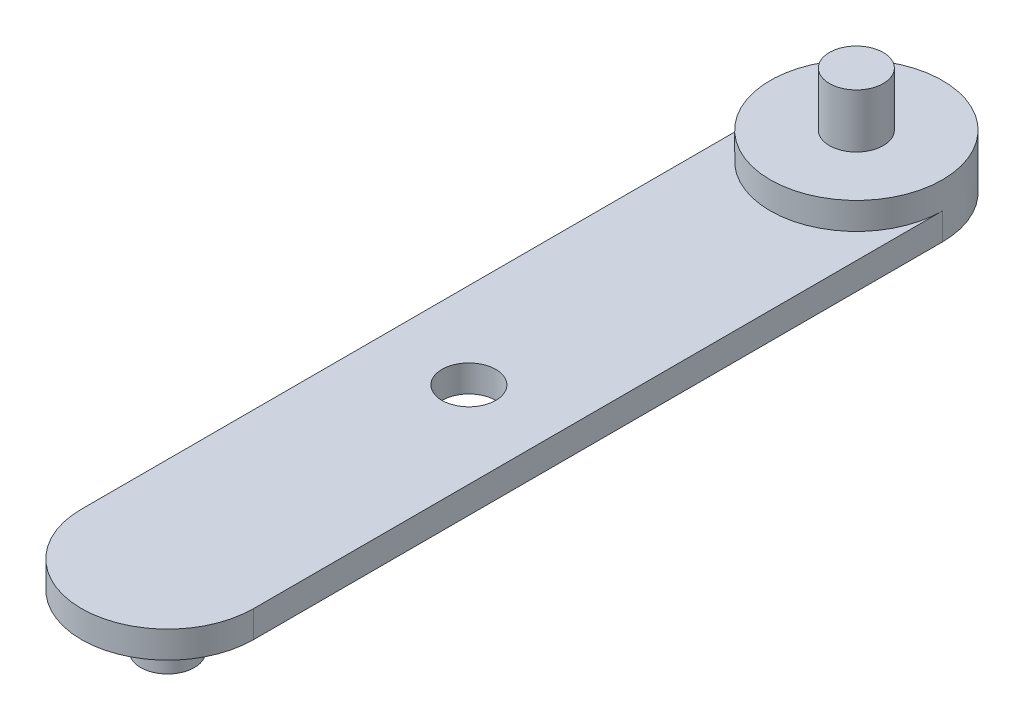
ISO-10303-21;
HEADER;
FILE_DESCRIPTION(('STEP AP214'),'2;1');
FILE_NAME('part.step','',(''),(''),'','','');
FILE_SCHEMA(('AUTOMOTIVE_DESIGN { 1 0 10303 214 1 1 1 1 }'));
ENDSEC;
DATA;
#1=APPLICATION_CONTEXT('core data for automotive mechanical design processes');
#2=APPLICATION_PROTOCOL_DEFINITION('international standard','automotive_design',2000,#1);
#3=PRODUCT_CONTEXT('',#1,'mechanical');
#4=PRODUCT('Part','Part','',(#3));
#5=PRODUCT_RELATED_PRODUCT_CATEGORY('part','',(#4));
#6=PRODUCT_DEFINITION_FORMATION('','',#4);
#7=PRODUCT_DEFINITION_CONTEXT('part definition',#1,'design');
#8=PRODUCT_DEFINITION('design','',#6,#7);
#9=PRODUCT_DEFINITION_SHAPE('','',#8);
#10=(LENGTH_UNIT() NAMED_UNIT(*) SI_UNIT(.MILLI.,.METRE.));
#11=(NAMED_UNIT(*) PLANE_ANGLE_UNIT() SI_UNIT($,.RADIAN.));
#12=(NAMED_UNIT(*) SI_UNIT($,.STERADIAN.) SOLID_ANGLE_UNIT());
#13=UNCERTAINTY_MEASURE_WITH_UNIT(LENGTH_MEASURE(1.E-05),#10,'distance_accuracy_value','');
#14=(GEOMETRIC_REPRESENTATION_CONTEXT(3) GLOBAL_UNCERTAINTY_ASSIGNED_CONTEXT((#13)) GLOBAL_UNIT_ASSIGNED_CONTEXT((#10,
#11,#12)) REPRESENTATION_CONTEXT('',''));
#15=CARTESIAN_POINT('',(0.,0.,0.));
#16=DIRECTION('',(0.,0.,1.));
#17=DIRECTION('',(1.,0.,0.));
#18=AXIS2_PLACEMENT_3D('',#15,#16,#17);
#19=CARTESIAN_POINT('',(0.,2.5,-32.));
#20=DIRECTION('',(0.,-1.,0.));
#21=DIRECTION('',(0.,0.,-1.));
#22=AXIS2_PLACEMENT_3D('',#19,#20,#21);
#23=CYLINDRICAL_SURFACE('',#22,4.);
#24=CARTESIAN_POINT('',(0.,1.25,-32.));
#25=DIRECTION('',(0.,1.,0.));
#26=DIRECTION('',(0.,0.,1.));
#27=AXIS2_PLACEMENT_3D('',#24,#25,#26);
#28=CIRCLE('',#27,4.);
#29=CARTESIAN_POINT('',(-4.,1.25,-32.));
#30=VERTEX_POINT('',#29);
#31=CARTESIAN_POINT('',(4.,1.25,-32.));
#32=VERTEX_POINT('',#31);
#33=EDGE_CURVE('E49',#30,#32,#28,.T.);
#34=ORIENTED_EDGE('',*,*,#33,.T.);
#35=DIRECTION('',(0.,-1.,0.));
#36=VECTOR('',#35,1.);
#37=CARTESIAN_POINT('',(4.,1.25,-32.));
#38=LINE('',#37,#36);
#39=CARTESIAN_POINT('',(4.,0.,-32.));
#40=VERTEX_POINT('',#39);
#41=EDGE_CURVE('E107',#32,#40,#38,.T.);
#42=ORIENTED_EDGE('',*,*,#41,.T.);
#43=CARTESIAN_POINT('',(0.,0.,-32.));
#44=DIRECTION('',(0.,1.,0.));
#45=DIRECTION('',(0.,0.,1.));
#46=AXIS2_PLACEMENT_3D('',#43,#44,#45);
#47=CIRCLE('',#46,4.);
#48=CARTESIAN_POINT('',(-4.,0.,-32.));
#49=VERTEX_POINT('',#48);
#50=EDGE_CURVE('E109',#40,#49,#47,.T.);
#51=ORIENTED_EDGE('',*,*,#50,.T.);
#52=DIRECTION('',(0.,-1.,0.));
#53=VECTOR('',#52,1.);
#54=CARTESIAN_POINT('',(-4.,1.25,-32.));
#55=LINE('',#54,#53);
#56=EDGE_CURVE('E54',#30,#49,#55,.T.);
#57=ORIENTED_EDGE('',*,*,#56,.F.);
#58=EDGE_LOOP('',(#34,#42,#51,#57));
#59=FACE_BOUND('',#58,.T.);
#60=CARTESIAN_POINT('',(0.,2.5,-32.));
#61=DIRECTION('',(0.,1.,0.));
#62=DIRECTION('',(0.,0.,1.));
#63=AXIS2_PLACEMENT_3D('',#60,#61,#62);
#64=CIRCLE('',#63,4.);
#65=CARTESIAN_POINT('',(0.,2.5,-28.));
#66=VERTEX_POINT('',#65);
#67=EDGE_CURVE('E110',#66,#66,#64,.T.);
#68=ORIENTED_EDGE('',*,*,#67,.F.);
#69=EDGE_LOOP('',(#68));
#70=FACE_BOUND('',#69,.T.);
#71=ADVANCED_FACE('F35',(#59,#70),#23,.T.);
#72=CARTESIAN_POINT('',(0.,2.5,0.));
#73=DIRECTION('',(0.,1.,0.));
#74=DIRECTION('',(0.,0.,1.));
#75=AXIS2_PLACEMENT_3D('',#72,#73,#74);
#76=PLANE('',#75);
#77=CARTESIAN_POINT('',(0.,2.5,-32.));
#78=DIRECTION('',(0.,1.,0.));
#79=DIRECTION('',(0.,0.,1.));
#80=AXIS2_PLACEMENT_3D('',#77,#78,#79);
#81=CIRCLE('',#80,1.25);
#82=CARTESIAN_POINT('',(0.,2.5,-30.75));
#83=VERTEX_POINT('',#82);
#84=EDGE_CURVE('E42',#83,#83,#81,.T.);
#85=ORIENTED_EDGE('',*,*,#84,.F.);
#86=EDGE_LOOP('',(#85));
#87=FACE_BOUND('',#86,.T.);
#88=ORIENTED_EDGE('',*,*,#67,.T.);
#89=EDGE_LOOP('',(#88));
#90=FACE_BOUND('',#89,.T.);
#91=ADVANCED_FACE('F149',(#87,#90),#76,.T.);
#92=CARTESIAN_POINT('',(0.,0.,0.));
#93=DIRECTION('',(0.,1.,0.));
#94=DIRECTION('',(0.,0.,1.));
#95=AXIS2_PLACEMENT_3D('',#92,#93,#94);
#96=PLANE('',#95);
#97=CARTESIAN_POINT('',(0.,0.,-14.));
#98=DIRECTION('',(0.,1.,0.));
#99=DIRECTION('',(0.,0.,1.));
#100=AXIS2_PLACEMENT_3D('',#97,#98,#99);
#101=CIRCLE('',#100,1.25);
#102=CARTESIAN_POINT('',(0.,0.,-12.75));
#103=VERTEX_POINT('',#102);
#104=EDGE_CURVE('E127',#103,#103,#101,.T.);
#105=ORIENTED_EDGE('',*,*,#104,.T.);
#106=EDGE_LOOP('',(#105));
#107=FACE_BOUND('',#106,.T.);
#108=CARTESIAN_POINT('',(0.,0.,0.));
#109=DIRECTION('',(0.,1.,0.));
#110=DIRECTION('',(0.,0.,1.));
#111=AXIS2_PLACEMENT_3D('',#108,#109,#110);
#112=CIRCLE('',#111,1.25);
#113=CARTESIAN_POINT('',(0.,0.,1.25));
#114=VERTEX_POINT('',#113);
#115=EDGE_CURVE('E11',#114,#114,#112,.F.);
#116=ORIENTED_EDGE('',*,*,#115,.F.);
#117=EDGE_LOOP('',(#116));
#118=FACE_BOUND('',#117,.T.);
#119=ORIENTED_EDGE('',*,*,#50,.F.);
#120=DIRECTION('',(0.,0.,-1.));
#121=VECTOR('',#120,1.);
#122=CARTESIAN_POINT('',(4.,0.,0.));
#123=LINE('',#122,#121);
#124=CARTESIAN_POINT('',(4.,0.,0.));
#125=VERTEX_POINT('',#124);
#126=EDGE_CURVE('E98',#125,#40,#123,.T.);
#127=ORIENTED_EDGE('',*,*,#126,.F.);
#128=CARTESIAN_POINT('',(0.,0.,0.));
#129=DIRECTION('',(0.,1.,0.));
#130=DIRECTION('',(0.,0.,1.));
#131=AXIS2_PLACEMENT_3D('',#128,#129,#130);
#132=CIRCLE('',#131,4.);
#133=CARTESIAN_POINT('',(-4.,0.,0.));
#134=VERTEX_POINT('',#133);
#135=EDGE_CURVE('E103',#134,#125,#132,.T.);
#136=ORIENTED_EDGE('',*,*,#135,.F.);
#137=DIRECTION('',(0.,0.,-1.));
#138=VECTOR('',#137,1.);
#139=CARTESIAN_POINT('',(-4.,0.,0.));
#140=LINE('',#139,#138);
#141=EDGE_CURVE('E80',#134,#49,#140,.T.);
#142=ORIENTED_EDGE('',*,*,#141,.T.);
#143=EDGE_LOOP('',(#119,#127,#136,#142));
#144=FACE_BOUND('',#143,.T.);
#145=ADVANCED_FACE('F116',(#107,#118,#144),#96,.F.);
#146=CARTESIAN_POINT('',(4.,1.25,0.));
#147=DIRECTION('',(-1.,0.,0.));
#148=DIRECTION('',(0.,0.,1.));
#149=AXIS2_PLACEMENT_3D('',#146,#147,#148);
#150=PLANE('',#149);
#151=ORIENTED_EDGE('',*,*,#126,.T.);
#152=ORIENTED_EDGE('',*,*,#41,.F.);
#153=DIRECTION('',(0.,0.,-1.));
#154=VECTOR('',#153,1.);
#155=CARTESIAN_POINT('',(4.,1.25,0.));
#156=LINE('',#155,#154);
#157=CARTESIAN_POINT('',(4.,1.25,0.));
#158=VERTEX_POINT('',#157);
#159=EDGE_CURVE('E94',#158,#32,#156,.T.);
#160=ORIENTED_EDGE('',*,*,#159,.F.);
#161=DIRECTION('',(0.,-1.,0.));
#162=VECTOR('',#161,1.);
#163=CARTESIAN_POINT('',(4.,1.25,0.));
#164=LINE('',#163,#162);
#165=EDGE_CURVE('E83',#158,#125,#164,.T.);
#166=ORIENTED_EDGE('',*,*,#165,.T.);
#167=EDGE_LOOP('',(#151,#152,#160,#166));
#168=FACE_BOUND('',#167,.T.);
#169=ADVANCED_FACE('F118',(#168),#150,.F.);
#170=CARTESIAN_POINT('',(-4.,1.25,0.));
#171=DIRECTION('',(-1.,0.,0.));
#172=DIRECTION('',(0.,0.,1.));
#173=AXIS2_PLACEMENT_3D('',#170,#171,#172);
#174=PLANE('',#173);
#175=ORIENTED_EDGE('',*,*,#141,.F.);
#176=DIRECTION('',(0.,-1.,0.));
#177=VECTOR('',#176,1.);
#178=CARTESIAN_POINT('',(-4.,1.25,0.));
#179=LINE('',#178,#177);
#180=CARTESIAN_POINT('',(-4.,1.25,0.));
#181=VERTEX_POINT('',#180);
#182=EDGE_CURVE('E74',#181,#134,#179,.T.);
#183=ORIENTED_EDGE('',*,*,#182,.F.);
#184=DIRECTION('',(0.,0.,-1.));
#185=VECTOR('',#184,1.);
#186=CARTESIAN_POINT('',(-4.,1.25,0.));
#187=LINE('',#186,#185);
#188=EDGE_CURVE('E78',#181,#30,#187,.T.);
#189=ORIENTED_EDGE('',*,*,#188,.T.);
#190=ORIENTED_EDGE('',*,*,#56,.T.);
#191=EDGE_LOOP('',(#175,#183,#189,#190));
#192=FACE_BOUND('',#191,.T.);
#193=ADVANCED_FACE('F76',(#192),#174,.T.);
#194=CARTESIAN_POINT('',(0.,1.25,0.));
#195=DIRECTION('',(0.,-1.,0.));
#196=DIRECTION('',(0.,0.,-1.));
#197=AXIS2_PLACEMENT_3D('',#194,#195,#196);
#198=CYLINDRICAL_SURFACE('',#197,4.);
#199=ORIENTED_EDGE('',*,*,#135,.T.);
#200=ORIENTED_EDGE('',*,*,#165,.F.);
#201=CARTESIAN_POINT('',(0.,1.25,0.));
#202=DIRECTION('',(0.,1.,0.));
#203=DIRECTION('',(0.,0.,1.));
#204=AXIS2_PLACEMENT_3D('',#201,#202,#203);
#205=CIRCLE('',#204,4.);
#206=EDGE_CURVE('E86',#181,#158,#205,.T.);
#207=ORIENTED_EDGE('',*,*,#206,.F.);
#208=ORIENTED_EDGE('',*,*,#182,.T.);
#209=EDGE_LOOP('',(#199,#200,#207,#208));
#210=FACE_BOUND('',#209,.T.);
#211=ADVANCED_FACE('F87',(#210),#198,.T.);
#212=CARTESIAN_POINT('',(0.,1.25,0.));
#213=DIRECTION('',(0.,1.,0.));
#214=DIRECTION('',(0.,0.,1.));
#215=AXIS2_PLACEMENT_3D('',#212,#213,#214);
#216=PLANE('',#215);
#217=CARTESIAN_POINT('',(0.,1.25,-14.));
#218=DIRECTION('',(0.,1.,0.));
#219=DIRECTION('',(0.,0.,1.));
#220=AXIS2_PLACEMENT_3D('',#217,#218,#219);
#221=CIRCLE('',#220,1.25);
#222=CARTESIAN_POINT('',(0.,1.25,-12.75));
#223=VERTEX_POINT('',#222);
#224=EDGE_CURVE('E130',#223,#223,#221,.T.);
#225=ORIENTED_EDGE('',*,*,#224,.F.);
#226=EDGE_LOOP('',(#225));
#227=FACE_BOUND('',#226,.T.);
#228=ORIENTED_EDGE('',*,*,#159,.T.);
#229=ORIENTED_EDGE('',*,*,#33,.F.);
#230=ORIENTED_EDGE('',*,*,#188,.F.);
#231=ORIENTED_EDGE('',*,*,#206,.T.);
#232=EDGE_LOOP('',(#228,#229,#230,#231));
#233=FACE_BOUND('',#232,.T.);
#234=ADVANCED_FACE('F92',(#227,#233),#216,.T.);
#235=CARTESIAN_POINT('',(0.,5.,-32.));
#236=DIRECTION('',(0.,-1.,0.));
#237=DIRECTION('',(0.,0.,-1.));
#238=AXIS2_PLACEMENT_3D('',#235,#236,#237);
#239=CYLINDRICAL_SURFACE('',#238,1.25);
#240=CARTESIAN_POINT('',(0.,5.,-32.));
#241=DIRECTION('',(0.,1.,0.));
#242=DIRECTION('',(0.,0.,1.));
#243=AXIS2_PLACEMENT_3D('',#240,#241,#242);
#244=CIRCLE('',#243,1.25);
#245=CARTESIAN_POINT('',(0.,5.,-30.75));
#246=VERTEX_POINT('',#245);
#247=EDGE_CURVE('E101',#246,#246,#244,.T.);
#248=ORIENTED_EDGE('',*,*,#247,.F.);
#249=EDGE_LOOP('',(#248));
#250=FACE_BOUND('',#249,.T.);
#251=ORIENTED_EDGE('',*,*,#84,.T.);
#252=EDGE_LOOP('',(#251));
#253=FACE_BOUND('',#252,.T.);
#254=ADVANCED_FACE('F138',(#250,#253),#239,.T.);
#255=CARTESIAN_POINT('',(0.,5.,-32.));
#256=DIRECTION('',(0.,1.,0.));
#257=DIRECTION('',(0.,0.,1.));
#258=AXIS2_PLACEMENT_3D('',#255,#256,#257);
#259=PLANE('',#258);
#260=ORIENTED_EDGE('',*,*,#247,.T.);
#261=EDGE_LOOP('',(#260));
#262=FACE_BOUND('',#261,.T.);
#263=ADVANCED_FACE('F144',(#262),#259,.T.);
#264=CARTESIAN_POINT('',(0.,-2.5,0.));
#265=DIRECTION('',(0.,1.,0.));
#266=DIRECTION('',(0.,0.,1.));
#267=AXIS2_PLACEMENT_3D('',#264,#265,#266);
#268=CYLINDRICAL_SURFACE('',#267,1.25);
#269=CARTESIAN_POINT('',(0.,-2.5,0.));
#270=DIRECTION('',(0.,-1.,0.));
#271=DIRECTION('',(0.,0.,-1.));
#272=AXIS2_PLACEMENT_3D('',#269,#270,#271);
#273=CIRCLE('',#272,1.25);
#274=CARTESIAN_POINT('',(0.,-2.5,-1.25));
#275=VERTEX_POINT('',#274);
#276=EDGE_CURVE('E124',#275,#275,#273,.T.);
#277=ORIENTED_EDGE('',*,*,#276,.F.);
#278=EDGE_LOOP('',(#277));
#279=FACE_BOUND('',#278,.T.);
#280=ORIENTED_EDGE('',*,*,#115,.T.);
#281=EDGE_LOOP('',(#280));
#282=FACE_BOUND('',#281,.T.);
#283=ADVANCED_FACE('F195',(#279,#282),#268,.T.);
#284=CARTESIAN_POINT('',(0.,-2.5,0.));
#285=DIRECTION('',(0.,-1.,0.));
#286=DIRECTION('',(0.,0.,-1.));
#287=AXIS2_PLACEMENT_3D('',#284,#285,#286);
#288=PLANE('',#287);
#289=ORIENTED_EDGE('',*,*,#276,.T.);
#290=EDGE_LOOP('',(#289));
#291=FACE_BOUND('',#290,.T.);
#292=ADVANCED_FACE('F205',(#291),#288,.T.);
#293=CARTESIAN_POINT('',(0.,-1.25,-14.));
#294=DIRECTION('',(0.,1.,0.));
#295=DIRECTION('',(0.,0.,1.));
#296=AXIS2_PLACEMENT_3D('',#293,#294,#295);
#297=CYLINDRICAL_SURFACE('',#296,1.25);
#298=ORIENTED_EDGE('',*,*,#224,.T.);
#299=EDGE_LOOP('',(#298));
#300=FACE_BOUND('',#299,.T.);
#301=ORIENTED_EDGE('',*,*,#104,.F.);
#302=EDGE_LOOP('',(#301));
#303=FACE_BOUND('',#302,.T.);
#304=ADVANCED_FACE('F134',(#300,#303),#297,.F.);
#305=CLOSED_SHELL('',(#71,#91,#145,#169,#193,#211,#234,#254,#263,#283,#292,#304));
#306=MANIFOLD_SOLID_BREP('B2',#305);
#307=ADVANCED_BREP_SHAPE_REPRESENTATION('',(#18,#306),#14);
#308=SHAPE_DEFINITION_REPRESENTATION(#9,#307);
ENDSEC;
END-ISO-10303-21;
